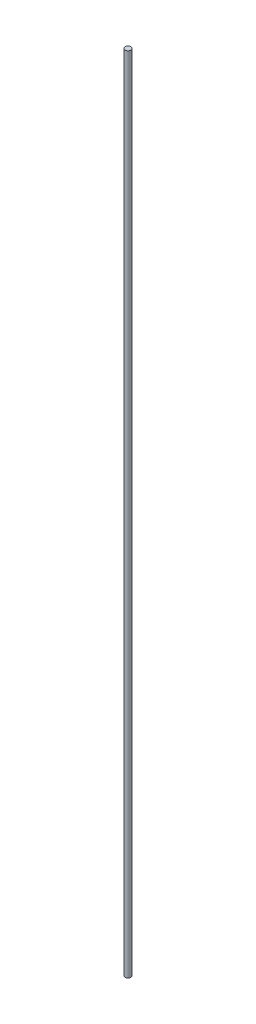
ISO-10303-21;
HEADER;
FILE_DESCRIPTION(('STEP AP214'),'2;1');
FILE_NAME('part.step','',(''),(''),'','','');
FILE_SCHEMA(('AUTOMOTIVE_DESIGN { 1 0 10303 214 1 1 1 1 }'));
ENDSEC;
DATA;
#1=APPLICATION_CONTEXT('core data for automotive mechanical design processes');
#2=APPLICATION_PROTOCOL_DEFINITION('international standard','automotive_design',2000,#1);
#3=PRODUCT_CONTEXT('',#1,'mechanical');
#4=PRODUCT('Part','Part','',(#3));
#5=PRODUCT_RELATED_PRODUCT_CATEGORY('part','',(#4));
#6=PRODUCT_DEFINITION_FORMATION('','',#4);
#7=PRODUCT_DEFINITION_CONTEXT('part definition',#1,'design');
#8=PRODUCT_DEFINITION('design','',#6,#7);
#9=PRODUCT_DEFINITION_SHAPE('','',#8);
#10=(LENGTH_UNIT() NAMED_UNIT(*) SI_UNIT(.MILLI.,.METRE.));
#11=(NAMED_UNIT(*) PLANE_ANGLE_UNIT() SI_UNIT($,.RADIAN.));
#12=(NAMED_UNIT(*) SI_UNIT($,.STERADIAN.) SOLID_ANGLE_UNIT());
#13=UNCERTAINTY_MEASURE_WITH_UNIT(LENGTH_MEASURE(1.E-05),#10,'distance_accuracy_value','');
#14=(GEOMETRIC_REPRESENTATION_CONTEXT(3) GLOBAL_UNCERTAINTY_ASSIGNED_CONTEXT((#13)) GLOBAL_UNIT_ASSIGNED_CONTEXT((#10,
#11,#12)) REPRESENTATION_CONTEXT('',''));
#15=CARTESIAN_POINT('',(0.,0.,0.));
#16=DIRECTION('',(0.,0.,1.));
#17=DIRECTION('',(1.,0.,0.));
#18=AXIS2_PLACEMENT_3D('',#15,#16,#17);
#19=CARTESIAN_POINT('',(0.,136.17,0.));
#20=DIRECTION('',(0.,-1.,0.));
#21=DIRECTION('',(0.,0.,-1.));
#22=AXIS2_PLACEMENT_3D('',#19,#20,#21);
#23=CYLINDRICAL_SURFACE('',#22,0.5);
#24=CARTESIAN_POINT('',(0.,136.17,0.));
#25=DIRECTION('',(0.,1.,0.));
#26=DIRECTION('',(0.,0.,1.));
#27=AXIS2_PLACEMENT_3D('',#24,#25,#26);
#28=CIRCLE('',#27,0.5);
#29=CARTESIAN_POINT('',(0.,136.17,0.5));
#30=VERTEX_POINT('',#29);
#31=EDGE_CURVE('E10',#30,#30,#28,.T.);
#32=ORIENTED_EDGE('',*,*,#31,.F.);
#33=EDGE_LOOP('',(#32));
#34=FACE_BOUND('',#33,.T.);
#35=CARTESIAN_POINT('',(0.,0.,0.));
#36=DIRECTION('',(0.,1.,0.));
#37=DIRECTION('',(0.,0.,1.));
#38=AXIS2_PLACEMENT_3D('',#35,#36,#37);
#39=CIRCLE('',#38,0.5);
#40=CARTESIAN_POINT('',(0.,0.,0.5));
#41=VERTEX_POINT('',#40);
#42=EDGE_CURVE('E40',#41,#41,#39,.T.);
#43=ORIENTED_EDGE('',*,*,#42,.T.);
#44=EDGE_LOOP('',(#43));
#45=FACE_BOUND('',#44,.T.);
#46=ADVANCED_FACE('F37',(#34,#45),#23,.T.);
#47=CARTESIAN_POINT('',(0.,136.17,0.));
#48=DIRECTION('',(0.,1.,0.));
#49=DIRECTION('',(0.,0.,1.));
#50=AXIS2_PLACEMENT_3D('',#47,#48,#49);
#51=PLANE('',#50);
#52=ORIENTED_EDGE('',*,*,#31,.T.);
#53=EDGE_LOOP('',(#52));
#54=FACE_BOUND('',#53,.T.);
#55=ADVANCED_FACE('F54',(#54),#51,.T.);
#56=CARTESIAN_POINT('',(0.,0.,0.));
#57=DIRECTION('',(0.,1.,0.));
#58=DIRECTION('',(0.,0.,1.));
#59=AXIS2_PLACEMENT_3D('',#56,#57,#58);
#60=PLANE('',#59);
#61=ORIENTED_EDGE('',*,*,#42,.F.);
#62=EDGE_LOOP('',(#61));
#63=FACE_BOUND('',#62,.T.);
#64=ADVANCED_FACE('F52',(#63),#60,.F.);
#65=CLOSED_SHELL('',(#46,#55,#64));
#66=MANIFOLD_SOLID_BREP('B2',#65);
#67=ADVANCED_BREP_SHAPE_REPRESENTATION('',(#18,#66),#14);
#68=SHAPE_DEFINITION_REPRESENTATION(#9,#67);
ENDSEC;
END-ISO-10303-21;
